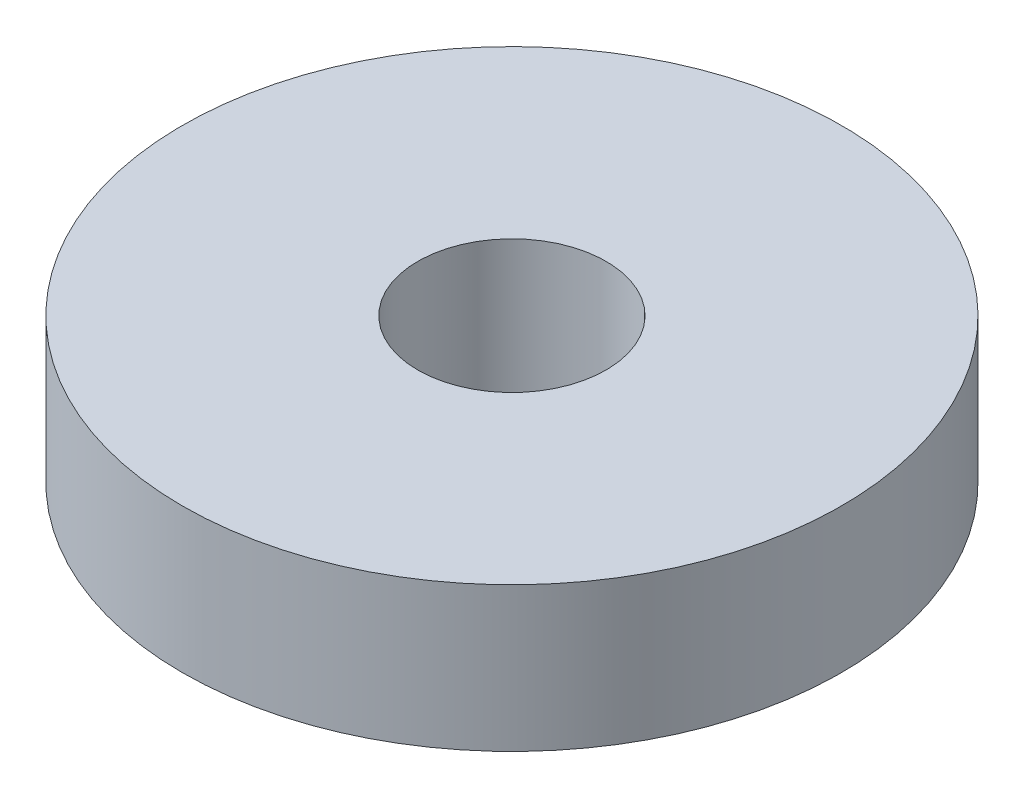
ISO-10303-21;
HEADER;
FILE_DESCRIPTION(('STEP AP214'),'2;1');
FILE_NAME('part.step','',(''),(''),'','','');
FILE_SCHEMA(('AUTOMOTIVE_DESIGN { 1 0 10303 214 1 1 1 1 }'));
ENDSEC;
DATA;
#1=APPLICATION_CONTEXT('core data for automotive mechanical design processes');
#2=APPLICATION_PROTOCOL_DEFINITION('international standard','automotive_design',2000,#1);
#3=PRODUCT_CONTEXT('',#1,'mechanical');
#4=PRODUCT('Part','Part','',(#3));
#5=PRODUCT_RELATED_PRODUCT_CATEGORY('part','',(#4));
#6=PRODUCT_DEFINITION_FORMATION('','',#4);
#7=PRODUCT_DEFINITION_CONTEXT('part definition',#1,'design');
#8=PRODUCT_DEFINITION('design','',#6,#7);
#9=PRODUCT_DEFINITION_SHAPE('','',#8);
#10=(LENGTH_UNIT() NAMED_UNIT(*) SI_UNIT(.MILLI.,.METRE.));
#11=(NAMED_UNIT(*) PLANE_ANGLE_UNIT() SI_UNIT($,.RADIAN.));
#12=(NAMED_UNIT(*) SI_UNIT($,.STERADIAN.) SOLID_ANGLE_UNIT());
#13=UNCERTAINTY_MEASURE_WITH_UNIT(LENGTH_MEASURE(1.E-05),#10,'distance_accuracy_value','');
#14=(GEOMETRIC_REPRESENTATION_CONTEXT(3) GLOBAL_UNCERTAINTY_ASSIGNED_CONTEXT((#13)) GLOBAL_UNIT_ASSIGNED_CONTEXT((#10,
#11,#12)) REPRESENTATION_CONTEXT('',''));
#15=CARTESIAN_POINT('',(0.,0.,0.));
#16=DIRECTION('',(0.,0.,1.));
#17=DIRECTION('',(1.,0.,0.));
#18=AXIS2_PLACEMENT_3D('',#15,#16,#17);
#19=CARTESIAN_POINT('',(0.,23.,0.));
#20=DIRECTION('',(0.,-1.,0.));
#21=DIRECTION('',(0.,0.,-1.));
#22=AXIS2_PLACEMENT_3D('',#19,#20,#21);
#23=CYLINDRICAL_SURFACE('',#22,52.5);
#24=CARTESIAN_POINT('',(0.,23.,0.));
#25=DIRECTION('',(0.,1.,0.));
#26=DIRECTION('',(0.,0.,1.));
#27=AXIS2_PLACEMENT_3D('',#24,#25,#26);
#28=CIRCLE('',#27,52.5);
#29=CARTESIAN_POINT('',(0.,23.,52.5));
#30=VERTEX_POINT('',#29);
#31=EDGE_CURVE('E10',#30,#30,#28,.T.);
#32=ORIENTED_EDGE('',*,*,#31,.F.);
#33=EDGE_LOOP('',(#32));
#34=FACE_BOUND('',#33,.T.);
#35=CARTESIAN_POINT('',(0.,0.,0.));
#36=DIRECTION('',(0.,1.,0.));
#37=DIRECTION('',(0.,0.,1.));
#38=AXIS2_PLACEMENT_3D('',#35,#36,#37);
#39=CIRCLE('',#38,52.5);
#40=CARTESIAN_POINT('',(0.,0.,52.5));
#41=VERTEX_POINT('',#40);
#42=EDGE_CURVE('E37',#41,#41,#39,.T.);
#43=ORIENTED_EDGE('',*,*,#42,.T.);
#44=EDGE_LOOP('',(#43));
#45=FACE_BOUND('',#44,.T.);
#46=ADVANCED_FACE('F40',(#34,#45),#23,.T.);
#47=CARTESIAN_POINT('',(0.,23.,0.));
#48=DIRECTION('',(0.,1.,0.));
#49=DIRECTION('',(0.,0.,1.));
#50=AXIS2_PLACEMENT_3D('',#47,#48,#49);
#51=PLANE('',#50);
#52=CARTESIAN_POINT('',(0.,23.,0.));
#53=DIRECTION('',(0.,1.,0.));
#54=DIRECTION('',(0.,0.,1.));
#55=AXIS2_PLACEMENT_3D('',#52,#53,#54);
#56=CIRCLE('',#55,15.);
#57=CARTESIAN_POINT('',(0.,23.,15.));
#58=VERTEX_POINT('',#57);
#59=EDGE_CURVE('E50',#58,#58,#56,.T.);
#60=ORIENTED_EDGE('',*,*,#59,.F.);
#61=EDGE_LOOP('',(#60));
#62=FACE_BOUND('',#61,.T.);
#63=ORIENTED_EDGE('',*,*,#31,.T.);
#64=EDGE_LOOP('',(#63));
#65=FACE_BOUND('',#64,.T.);
#66=ADVANCED_FACE('F59',(#62,#65),#51,.T.);
#67=CARTESIAN_POINT('',(0.,0.,0.));
#68=DIRECTION('',(0.,1.,0.));
#69=DIRECTION('',(0.,0.,1.));
#70=AXIS2_PLACEMENT_3D('',#67,#68,#69);
#71=PLANE('',#70);
#72=CARTESIAN_POINT('',(0.,0.,0.));
#73=DIRECTION('',(0.,1.,0.));
#74=DIRECTION('',(0.,0.,1.));
#75=AXIS2_PLACEMENT_3D('',#72,#73,#74);
#76=CIRCLE('',#75,15.);
#77=CARTESIAN_POINT('',(0.,0.,15.));
#78=VERTEX_POINT('',#77);
#79=EDGE_CURVE('E47',#78,#78,#76,.T.);
#80=ORIENTED_EDGE('',*,*,#79,.T.);
#81=EDGE_LOOP('',(#80));
#82=FACE_BOUND('',#81,.T.);
#83=ORIENTED_EDGE('',*,*,#42,.F.);
#84=EDGE_LOOP('',(#83));
#85=FACE_BOUND('',#84,.T.);
#86=ADVANCED_FACE('F58',(#82,#85),#71,.F.);
#87=CARTESIAN_POINT('',(0.,23.,0.));
#88=DIRECTION('',(0.,-1.,0.));
#89=DIRECTION('',(0.,0.,-1.));
#90=AXIS2_PLACEMENT_3D('',#87,#88,#89);
#91=CYLINDRICAL_SURFACE('',#90,15.);
#92=ORIENTED_EDGE('',*,*,#59,.T.);
#93=EDGE_LOOP('',(#92));
#94=FACE_BOUND('',#93,.T.);
#95=ORIENTED_EDGE('',*,*,#79,.F.);
#96=EDGE_LOOP('',(#95));
#97=FACE_BOUND('',#96,.T.);
#98=ADVANCED_FACE('F54',(#94,#97),#91,.F.);
#99=CLOSED_SHELL('',(#46,#66,#86,#98));
#100=MANIFOLD_SOLID_BREP('B2',#99);
#101=ADVANCED_BREP_SHAPE_REPRESENTATION('',(#18,#100),#14);
#102=SHAPE_DEFINITION_REPRESENTATION(#9,#101);
ENDSEC;
END-ISO-10303-21;
